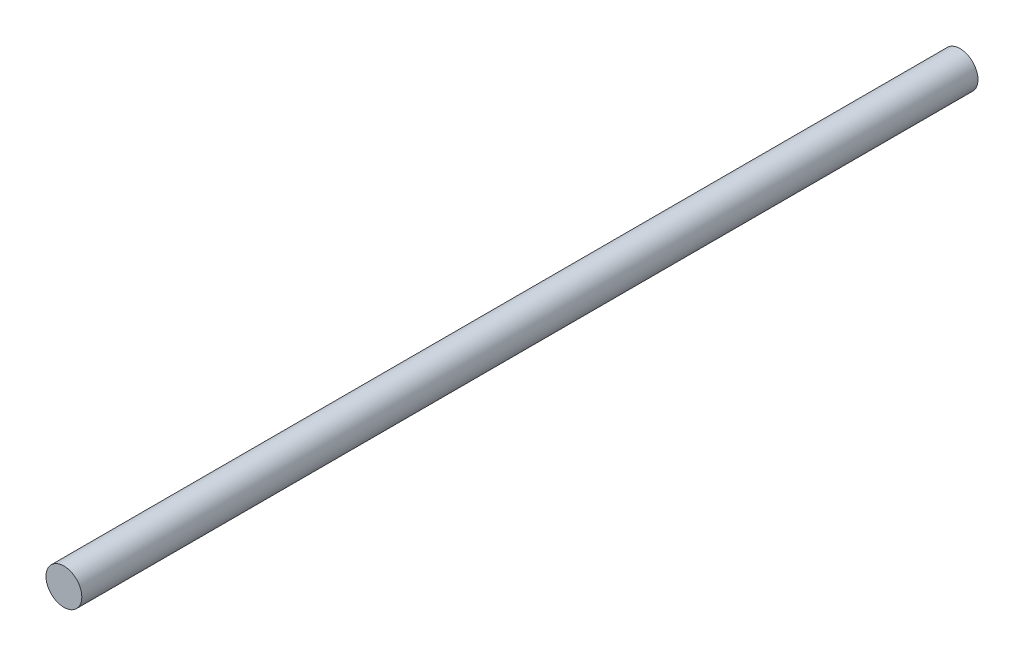
ISO-10303-21;
HEADER;
FILE_DESCRIPTION(('STEP AP214'),'2;1');
FILE_NAME('part.step','',(''),(''),'','','');
FILE_SCHEMA(('AUTOMOTIVE_DESIGN { 1 0 10303 214 1 1 1 1 }'));
ENDSEC;
DATA;
#1=APPLICATION_CONTEXT('core data for automotive mechanical design processes');
#2=APPLICATION_PROTOCOL_DEFINITION('international standard','automotive_design',2000,#1);
#3=PRODUCT_CONTEXT('',#1,'mechanical');
#4=PRODUCT('Part','Part','',(#3));
#5=PRODUCT_RELATED_PRODUCT_CATEGORY('part','',(#4));
#6=PRODUCT_DEFINITION_FORMATION('','',#4);
#7=PRODUCT_DEFINITION_CONTEXT('part definition',#1,'design');
#8=PRODUCT_DEFINITION('design','',#6,#7);
#9=PRODUCT_DEFINITION_SHAPE('','',#8);
#10=(LENGTH_UNIT() NAMED_UNIT(*) SI_UNIT(.MILLI.,.METRE.));
#11=(NAMED_UNIT(*) PLANE_ANGLE_UNIT() SI_UNIT($,.RADIAN.));
#12=(NAMED_UNIT(*) SI_UNIT($,.STERADIAN.) SOLID_ANGLE_UNIT());
#13=UNCERTAINTY_MEASURE_WITH_UNIT(LENGTH_MEASURE(1.E-05),#10,'distance_accuracy_value','');
#14=(GEOMETRIC_REPRESENTATION_CONTEXT(3) GLOBAL_UNCERTAINTY_ASSIGNED_CONTEXT((#13)) GLOBAL_UNIT_ASSIGNED_CONTEXT((#10,
#11,#12)) REPRESENTATION_CONTEXT('',''));
#15=CARTESIAN_POINT('',(0.,0.,0.));
#16=DIRECTION('',(0.,0.,1.));
#17=DIRECTION('',(1.,0.,0.));
#18=AXIS2_PLACEMENT_3D('',#15,#16,#17);
#19=CARTESIAN_POINT('',(1.3,7.00000000000402,-16.2));
#20=DIRECTION('',(0.,0.,1.));
#21=DIRECTION('',(1.,0.,0.));
#22=AXIS2_PLACEMENT_3D('',#19,#20,#21);
#23=PLANE('',#22);
#24=CARTESIAN_POINT('',(1.3,7.00000000000402,-16.2));
#25=DIRECTION('',(0.,0.,1.));
#26=DIRECTION('',(-1.,0.,0.));
#27=AXIS2_PLACEMENT_3D('',#24,#25,#26);
#28=CIRCLE('',#27,0.6);
#29=CARTESIAN_POINT('',(1.9,7.00000000000402,-16.2));
#30=VERTEX_POINT('',#29);
#31=EDGE_CURVE('E11',#30,#30,#28,.T.);
#32=ORIENTED_EDGE('',*,*,#31,.F.);
#33=EDGE_LOOP('',(#32));
#34=FACE_BOUND('',#33,.T.);
#35=ADVANCED_FACE('F17',(#34),#23,.F.);
#36=CARTESIAN_POINT('',(1.3,7.00000000000402,13.8));
#37=DIRECTION('',(0.,0.,1.));
#38=DIRECTION('',(1.,0.,0.));
#39=AXIS2_PLACEMENT_3D('',#36,#37,#38);
#40=PLANE('',#39);
#41=CARTESIAN_POINT('',(1.3,7.00000000000402,13.8));
#42=DIRECTION('',(0.,0.,1.));
#43=DIRECTION('',(-1.,0.,0.));
#44=AXIS2_PLACEMENT_3D('',#41,#42,#43);
#45=CIRCLE('',#44,0.6);
#46=CARTESIAN_POINT('',(1.9,7.00000000000402,13.8));
#47=VERTEX_POINT('',#46);
#48=EDGE_CURVE('E42',#47,#47,#45,.T.);
#49=ORIENTED_EDGE('',*,*,#48,.T.);
#50=EDGE_LOOP('',(#49));
#51=FACE_BOUND('',#50,.T.);
#52=ADVANCED_FACE('F19',(#51),#40,.T.);
#53=CARTESIAN_POINT('',(1.3,7.00000000000402,-16.2));
#54=DIRECTION('',(0.,0.,1.));
#55=DIRECTION('',(-1.,0.,0.));
#56=AXIS2_PLACEMENT_3D('',#53,#54,#55);
#57=CYLINDRICAL_SURFACE('',#56,0.6);
#58=ORIENTED_EDGE('',*,*,#48,.F.);
#59=DIRECTION('',(0.,0.,-1.));
#60=VECTOR('',#59,1.);
#61=CARTESIAN_POINT('',(1.9,7.00000000000402,-16.2));
#62=LINE('',#61,#60);
#63=EDGE_CURVE('E27',#47,#30,#62,.T.);
#64=ORIENTED_EDGE('',*,*,#63,.T.);
#65=ORIENTED_EDGE('',*,*,#31,.T.);
#66=ORIENTED_EDGE('',*,*,#63,.F.);
#67=EDGE_LOOP('',(#58,#64,#65,#66));
#68=FACE_BOUND('',#67,.T.);
#69=ADVANCED_FACE('F41',(#68),#57,.T.);
#70=CLOSED_SHELL('',(#35,#52,#69));
#71=MANIFOLD_SOLID_BREP('B1',#70);
#72=ADVANCED_BREP_SHAPE_REPRESENTATION('',(#18,#71),#14);
#73=SHAPE_DEFINITION_REPRESENTATION(#9,#72);
ENDSEC;
END-ISO-10303-21;
